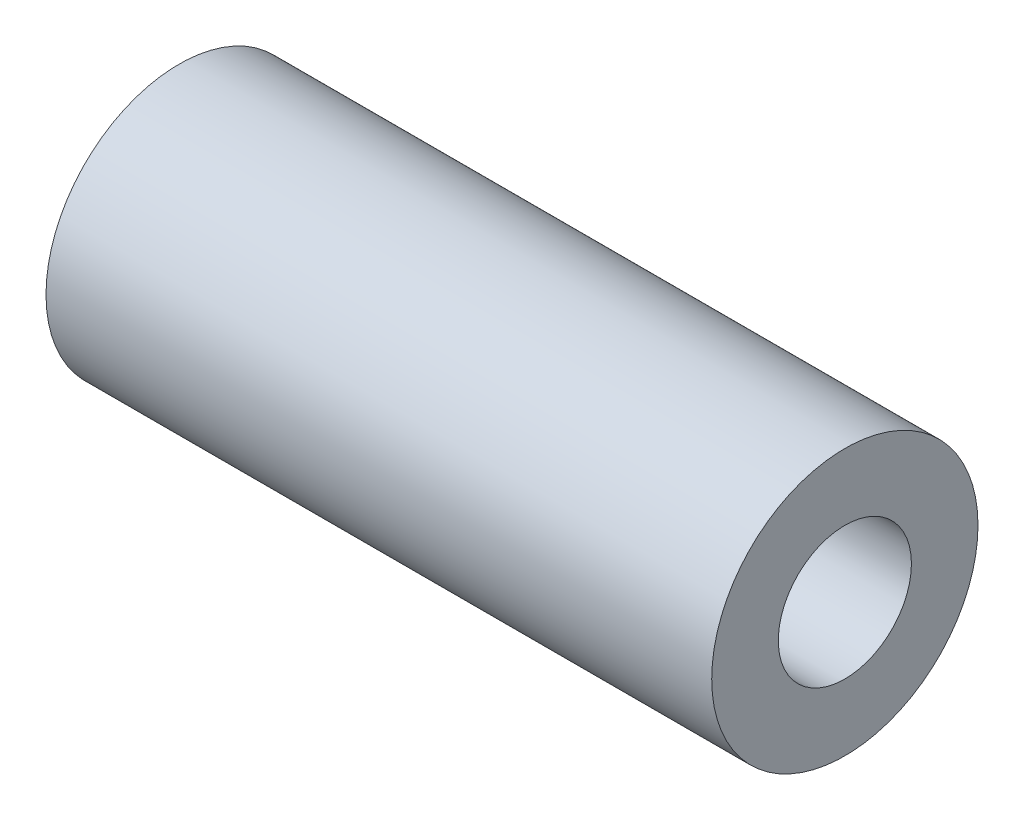
ISO-10303-21;
HEADER;
FILE_DESCRIPTION(('STEP AP214'),'2;1');
FILE_NAME('part.step','',(''),(''),'','','');
FILE_SCHEMA(('AUTOMOTIVE_DESIGN { 1 0 10303 214 1 1 1 1 }'));
ENDSEC;
DATA;
#1=APPLICATION_CONTEXT('core data for automotive mechanical design processes');
#2=APPLICATION_PROTOCOL_DEFINITION('international standard','automotive_design',2000,#1);
#3=PRODUCT_CONTEXT('',#1,'mechanical');
#4=PRODUCT('Part','Part','',(#3));
#5=PRODUCT_RELATED_PRODUCT_CATEGORY('part','',(#4));
#6=PRODUCT_DEFINITION_FORMATION('','',#4);
#7=PRODUCT_DEFINITION_CONTEXT('part definition',#1,'design');
#8=PRODUCT_DEFINITION('design','',#6,#7);
#9=PRODUCT_DEFINITION_SHAPE('','',#8);
#10=(LENGTH_UNIT() NAMED_UNIT(*) SI_UNIT(.MILLI.,.METRE.));
#11=(NAMED_UNIT(*) PLANE_ANGLE_UNIT() SI_UNIT($,.RADIAN.));
#12=(NAMED_UNIT(*) SI_UNIT($,.STERADIAN.) SOLID_ANGLE_UNIT());
#13=UNCERTAINTY_MEASURE_WITH_UNIT(LENGTH_MEASURE(1.E-05),#10,'distance_accuracy_value','');
#14=(GEOMETRIC_REPRESENTATION_CONTEXT(3) GLOBAL_UNCERTAINTY_ASSIGNED_CONTEXT((#13)) GLOBAL_UNIT_ASSIGNED_CONTEXT((#10,
#11,#12)) REPRESENTATION_CONTEXT('',''));
#15=CARTESIAN_POINT('',(0.,0.,0.));
#16=DIRECTION('',(0.,0.,1.));
#17=DIRECTION('',(1.,0.,0.));
#18=AXIS2_PLACEMENT_3D('',#15,#16,#17);
#19=CARTESIAN_POINT('',(63.5,0.,0.));
#20=DIRECTION('',(1.,0.,0.));
#21=DIRECTION('',(0.,0.,-1.));
#22=AXIS2_PLACEMENT_3D('',#19,#20,#21);
#23=PLANE('',#22);
#24=CARTESIAN_POINT('',(63.5,0.,0.));
#25=DIRECTION('',(1.,0.,0.));
#26=DIRECTION('',(0.,0.,-1.));
#27=AXIS2_PLACEMENT_3D('',#24,#25,#26);
#28=CIRCLE('',#27,25.4);
#29=CARTESIAN_POINT('',(63.5,0.,-25.4));
#30=VERTEX_POINT('',#29);
#31=EDGE_CURVE('E10',#30,#30,#28,.T.);
#32=ORIENTED_EDGE('',*,*,#31,.T.);
#33=EDGE_LOOP('',(#32));
#34=FACE_BOUND('',#33,.T.);
#35=CARTESIAN_POINT('',(63.5,0.,0.));
#36=DIRECTION('',(1.,0.,0.));
#37=DIRECTION('',(0.,0.,-1.));
#38=AXIS2_PLACEMENT_3D('',#35,#36,#37);
#39=CIRCLE('',#38,12.7);
#40=CARTESIAN_POINT('',(63.5,0.,-12.7));
#41=VERTEX_POINT('',#40);
#42=EDGE_CURVE('E42',#41,#41,#39,.T.);
#43=ORIENTED_EDGE('',*,*,#42,.F.);
#44=EDGE_LOOP('',(#43));
#45=FACE_BOUND('',#44,.T.);
#46=ADVANCED_FACE('F31',(#34,#45),#23,.T.);
#47=CARTESIAN_POINT('',(-63.5,0.,0.));
#48=DIRECTION('',(1.,0.,0.));
#49=DIRECTION('',(0.,0.,-1.));
#50=AXIS2_PLACEMENT_3D('',#47,#48,#49);
#51=PLANE('',#50);
#52=CARTESIAN_POINT('',(-63.5,0.,0.));
#53=DIRECTION('',(1.,0.,0.));
#54=DIRECTION('',(0.,0.,-1.));
#55=AXIS2_PLACEMENT_3D('',#52,#53,#54);
#56=CIRCLE('',#55,25.4);
#57=CARTESIAN_POINT('',(-63.5,0.,-25.4));
#58=VERTEX_POINT('',#57);
#59=EDGE_CURVE('E35',#58,#58,#56,.T.);
#60=ORIENTED_EDGE('',*,*,#59,.F.);
#61=EDGE_LOOP('',(#60));
#62=FACE_BOUND('',#61,.T.);
#63=CARTESIAN_POINT('',(-63.5,0.,0.));
#64=DIRECTION('',(1.,0.,0.));
#65=DIRECTION('',(0.,0.,-1.));
#66=AXIS2_PLACEMENT_3D('',#63,#64,#65);
#67=CIRCLE('',#66,12.7);
#68=CARTESIAN_POINT('',(-63.5,0.,-12.7));
#69=VERTEX_POINT('',#68);
#70=EDGE_CURVE('E44',#69,#69,#67,.T.);
#71=ORIENTED_EDGE('',*,*,#70,.T.);
#72=EDGE_LOOP('',(#71));
#73=FACE_BOUND('',#72,.T.);
#74=ADVANCED_FACE('F54',(#62,#73),#51,.F.);
#75=CARTESIAN_POINT('',(63.5,0.,0.));
#76=DIRECTION('',(-1.,0.,0.));
#77=DIRECTION('',(0.,0.,1.));
#78=AXIS2_PLACEMENT_3D('',#75,#76,#77);
#79=CYLINDRICAL_SURFACE('',#78,25.4);
#80=ORIENTED_EDGE('',*,*,#31,.F.);
#81=EDGE_LOOP('',(#80));
#82=FACE_BOUND('',#81,.T.);
#83=ORIENTED_EDGE('',*,*,#59,.T.);
#84=EDGE_LOOP('',(#83));
#85=FACE_BOUND('',#84,.T.);
#86=ADVANCED_FACE('F33',(#82,#85),#79,.T.);
#87=CARTESIAN_POINT('',(63.5,0.,0.));
#88=DIRECTION('',(-1.,0.,0.));
#89=DIRECTION('',(0.,0.,1.));
#90=AXIS2_PLACEMENT_3D('',#87,#88,#89);
#91=CYLINDRICAL_SURFACE('',#90,12.7);
#92=ORIENTED_EDGE('',*,*,#42,.T.);
#93=EDGE_LOOP('',(#92));
#94=FACE_BOUND('',#93,.T.);
#95=ORIENTED_EDGE('',*,*,#70,.F.);
#96=EDGE_LOOP('',(#95));
#97=FACE_BOUND('',#96,.T.);
#98=ADVANCED_FACE('F50',(#94,#97),#91,.F.);
#99=CLOSED_SHELL('',(#46,#74,#86,#98));
#100=MANIFOLD_SOLID_BREP('B2',#99);
#101=ADVANCED_BREP_SHAPE_REPRESENTATION('',(#18,#100),#14);
#102=SHAPE_DEFINITION_REPRESENTATION(#9,#101);
ENDSEC;
END-ISO-10303-21;
